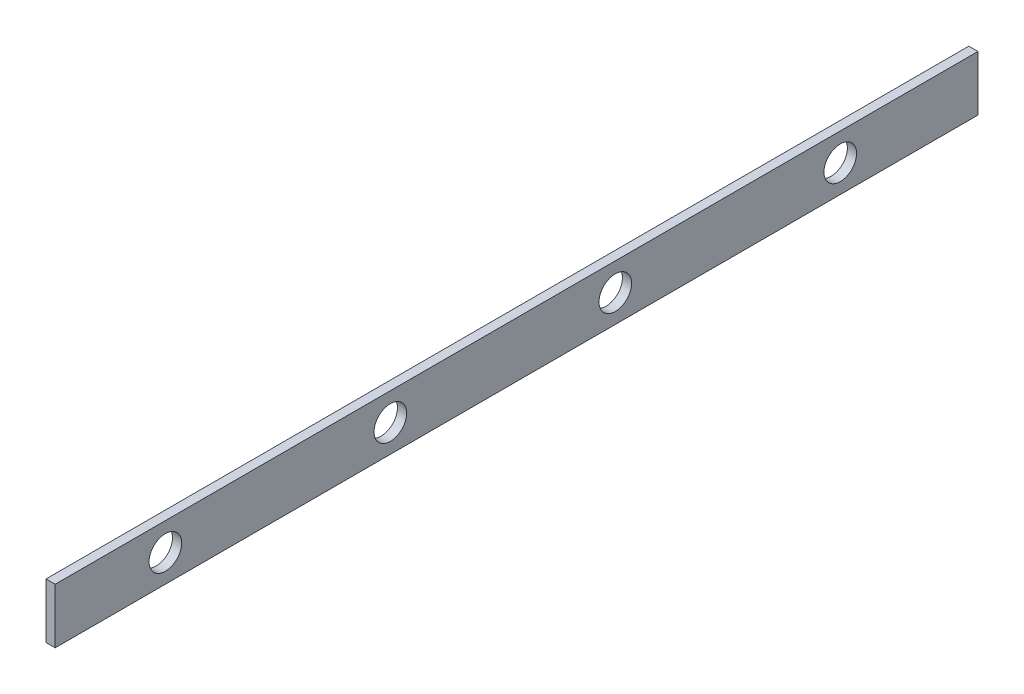
ISO-10303-21;
HEADER;
FILE_DESCRIPTION(('STEP AP214'),'2;1');
FILE_NAME('part.step','',(''),(''),'','','');
FILE_SCHEMA(('AUTOMOTIVE_DESIGN { 1 0 10303 214 1 1 1 1 }'));
ENDSEC;
DATA;
#1=APPLICATION_CONTEXT('core data for automotive mechanical design processes');
#2=APPLICATION_PROTOCOL_DEFINITION('international standard','automotive_design',2000,#1);
#3=PRODUCT_CONTEXT('',#1,'mechanical');
#4=PRODUCT('Part','Part','',(#3));
#5=PRODUCT_RELATED_PRODUCT_CATEGORY('part','',(#4));
#6=PRODUCT_DEFINITION_FORMATION('','',#4);
#7=PRODUCT_DEFINITION_CONTEXT('part definition',#1,'design');
#8=PRODUCT_DEFINITION('design','',#6,#7);
#9=PRODUCT_DEFINITION_SHAPE('','',#8);
#10=(LENGTH_UNIT() NAMED_UNIT(*) SI_UNIT(.MILLI.,.METRE.));
#11=(NAMED_UNIT(*) PLANE_ANGLE_UNIT() SI_UNIT($,.RADIAN.));
#12=(NAMED_UNIT(*) SI_UNIT($,.STERADIAN.) SOLID_ANGLE_UNIT());
#13=UNCERTAINTY_MEASURE_WITH_UNIT(LENGTH_MEASURE(1.E-05),#10,'distance_accuracy_value','');
#14=(GEOMETRIC_REPRESENTATION_CONTEXT(3) GLOBAL_UNCERTAINTY_ASSIGNED_CONTEXT((#13)) GLOBAL_UNIT_ASSIGNED_CONTEXT((#10,
#11,#12)) REPRESENTATION_CONTEXT('',''));
#15=CARTESIAN_POINT('',(0.,0.,0.));
#16=DIRECTION('',(0.,0.,1.));
#17=DIRECTION('',(1.,0.,0.));
#18=AXIS2_PLACEMENT_3D('',#15,#16,#17);
#19=CARTESIAN_POINT('',(600.,-60.000000000001,-502.500000000001));
#20=DIRECTION('',(0.,1.,0.));
#21=DIRECTION('',(0.,0.,1.));
#22=AXIS2_PLACEMENT_3D('',#19,#20,#21);
#23=PLANE('',#22);
#24=DIRECTION('',(-1.,0.,0.));
#25=VECTOR('',#24,1.);
#26=CARTESIAN_POINT('',(600.,-60.000000000001,502.499999999999));
#27=LINE('',#26,#25);
#28=CARTESIAN_POINT('',(610.,-60.000000000001,502.499999999999));
#29=VERTEX_POINT('',#28);
#30=CARTESIAN_POINT('',(600.,-60.000000000001,502.499999999999));
#31=VERTEX_POINT('',#30);
#32=EDGE_CURVE('E97',#29,#31,#27,.T.);
#33=ORIENTED_EDGE('',*,*,#32,.T.);
#34=DIRECTION('',(0.,0.,1.));
#35=VECTOR('',#34,1.);
#36=CARTESIAN_POINT('',(600.,-60.000000000001,-502.500000000001));
#37=LINE('',#36,#35);
#38=CARTESIAN_POINT('',(600.,-60.000000000001,-502.500000000001));
#39=VERTEX_POINT('',#38);
#40=EDGE_CURVE('E11',#39,#31,#37,.T.);
#41=ORIENTED_EDGE('',*,*,#40,.F.);
#42=DIRECTION('',(-1.,0.,0.));
#43=VECTOR('',#42,1.);
#44=CARTESIAN_POINT('',(600.,-60.000000000001,-502.500000000001));
#45=LINE('',#44,#43);
#46=CARTESIAN_POINT('',(610.,-60.000000000001,-502.500000000001));
#47=VERTEX_POINT('',#46);
#48=EDGE_CURVE('E85',#47,#39,#45,.T.);
#49=ORIENTED_EDGE('',*,*,#48,.F.);
#50=DIRECTION('',(0.,0.,1.));
#51=VECTOR('',#50,1.);
#52=CARTESIAN_POINT('',(610.,-60.000000000001,-502.500000000001));
#53=LINE('',#52,#51);
#54=EDGE_CURVE('E93',#47,#29,#53,.T.);
#55=ORIENTED_EDGE('',*,*,#54,.T.);
#56=EDGE_LOOP('',(#33,#41,#49,#55));
#57=FACE_BOUND('',#56,.T.);
#58=ADVANCED_FACE('F34',(#57),#23,.F.);
#59=CARTESIAN_POINT('',(600.,-60.000000000001,-502.500000000001));
#60=DIRECTION('',(1.,0.,0.));
#61=DIRECTION('',(0.,0.,-1.));
#62=AXIS2_PLACEMENT_3D('',#59,#60,#61);
#63=PLANE('',#62);
#64=CARTESIAN_POINT('',(600.,-30.0000000000042,382.499999999999));
#65=DIRECTION('',(1.,0.,0.));
#66=DIRECTION('',(0.,0.,-1.));
#67=AXIS2_PLACEMENT_3D('',#64,#65,#66);
#68=CIRCLE('',#67,17.75);
#69=CARTESIAN_POINT('',(600.,-30.0000000000042,364.75));
#70=VERTEX_POINT('',#69);
#71=EDGE_CURVE('E128',#70,#70,#68,.T.);
#72=ORIENTED_EDGE('',*,*,#71,.T.);
#73=EDGE_LOOP('',(#72));
#74=FACE_BOUND('',#73,.T.);
#75=CARTESIAN_POINT('',(600.,-30.0000000000042,137.5));
#76=DIRECTION('',(1.,0.,0.));
#77=DIRECTION('',(0.,0.,-1.));
#78=AXIS2_PLACEMENT_3D('',#75,#76,#77);
#79=CIRCLE('',#78,17.75);
#80=CARTESIAN_POINT('',(600.,-30.0000000000042,119.75));
#81=VERTEX_POINT('',#80);
#82=EDGE_CURVE('E122',#81,#81,#79,.T.);
#83=ORIENTED_EDGE('',*,*,#82,.T.);
#84=EDGE_LOOP('',(#83));
#85=FACE_BOUND('',#84,.T.);
#86=CARTESIAN_POINT('',(600.,-30.0000000000042,-107.5));
#87=DIRECTION('',(1.,0.,0.));
#88=DIRECTION('',(0.,0.,-1.));
#89=AXIS2_PLACEMENT_3D('',#86,#87,#88);
#90=CIRCLE('',#89,17.75);
#91=CARTESIAN_POINT('',(600.,-30.0000000000042,-125.25));
#92=VERTEX_POINT('',#91);
#93=EDGE_CURVE('E116',#92,#92,#90,.T.);
#94=ORIENTED_EDGE('',*,*,#93,.T.);
#95=EDGE_LOOP('',(#94));
#96=FACE_BOUND('',#95,.T.);
#97=CARTESIAN_POINT('',(600.,-30.0000000000042,-352.5));
#98=DIRECTION('',(1.,0.,0.));
#99=DIRECTION('',(0.,0.,-1.));
#100=AXIS2_PLACEMENT_3D('',#97,#98,#99);
#101=CIRCLE('',#100,17.75);
#102=CARTESIAN_POINT('',(600.,-30.0000000000042,-370.25));
#103=VERTEX_POINT('',#102);
#104=EDGE_CURVE('E100',#103,#103,#101,.T.);
#105=ORIENTED_EDGE('',*,*,#104,.T.);
#106=EDGE_LOOP('',(#105));
#107=FACE_BOUND('',#106,.T.);
#108=DIRECTION('',(0.,1.,0.));
#109=VECTOR('',#108,1.);
#110=CARTESIAN_POINT('',(600.,-60.000000000001,502.499999999999));
#111=LINE('',#110,#109);
#112=CARTESIAN_POINT('',(600.,0.,502.499999999999));
#113=VERTEX_POINT('',#112);
#114=EDGE_CURVE('E89',#31,#113,#111,.T.);
#115=ORIENTED_EDGE('',*,*,#114,.T.);
#116=DIRECTION('',(0.,0.,1.));
#117=VECTOR('',#116,1.);
#118=CARTESIAN_POINT('',(600.,0.,-502.500000000001));
#119=LINE('',#118,#117);
#120=CARTESIAN_POINT('',(600.,0.,-502.500000000001));
#121=VERTEX_POINT('',#120);
#122=EDGE_CURVE('E42',#121,#113,#119,.T.);
#123=ORIENTED_EDGE('',*,*,#122,.F.);
#124=DIRECTION('',(0.,1.,0.));
#125=VECTOR('',#124,1.);
#126=CARTESIAN_POINT('',(600.,-60.000000000001,-502.500000000001));
#127=LINE('',#126,#125);
#128=EDGE_CURVE('E80',#39,#121,#127,.T.);
#129=ORIENTED_EDGE('',*,*,#128,.F.);
#130=ORIENTED_EDGE('',*,*,#40,.T.);
#131=EDGE_LOOP('',(#115,#123,#129,#130));
#132=FACE_BOUND('',#131,.T.);
#133=ADVANCED_FACE('F88',(#74,#85,#96,#107,#132),#63,.F.);
#134=CARTESIAN_POINT('',(610.,0.,-502.500000000001));
#135=DIRECTION('',(0.,-1.,0.));
#136=DIRECTION('',(0.,0.,-1.));
#137=AXIS2_PLACEMENT_3D('',#134,#135,#136);
#138=PLANE('',#137);
#139=DIRECTION('',(1.,0.,0.));
#140=VECTOR('',#139,1.);
#141=CARTESIAN_POINT('',(610.,0.,502.499999999999));
#142=LINE('',#141,#140);
#143=CARTESIAN_POINT('',(610.,0.,502.499999999999));
#144=VERTEX_POINT('',#143);
#145=EDGE_CURVE('E67',#113,#144,#142,.T.);
#146=ORIENTED_EDGE('',*,*,#145,.T.);
#147=DIRECTION('',(0.,0.,1.));
#148=VECTOR('',#147,1.);
#149=CARTESIAN_POINT('',(610.,0.,-502.500000000001));
#150=LINE('',#149,#148);
#151=CARTESIAN_POINT('',(610.,0.,-502.500000000001));
#152=VERTEX_POINT('',#151);
#153=EDGE_CURVE('E90',#152,#144,#150,.T.);
#154=ORIENTED_EDGE('',*,*,#153,.F.);
#155=DIRECTION('',(1.,0.,0.));
#156=VECTOR('',#155,1.);
#157=CARTESIAN_POINT('',(610.,0.,-502.500000000001));
#158=LINE('',#157,#156);
#159=EDGE_CURVE('E83',#121,#152,#158,.T.);
#160=ORIENTED_EDGE('',*,*,#159,.F.);
#161=ORIENTED_EDGE('',*,*,#122,.T.);
#162=EDGE_LOOP('',(#146,#154,#160,#161));
#163=FACE_BOUND('',#162,.T.);
#164=ADVANCED_FACE('F91',(#163),#138,.F.);
#165=CARTESIAN_POINT('',(610.,-60.000000000001,-502.500000000001));
#166=DIRECTION('',(-1.,0.,0.));
#167=DIRECTION('',(0.,0.,1.));
#168=AXIS2_PLACEMENT_3D('',#165,#166,#167);
#169=PLANE('',#168);
#170=CARTESIAN_POINT('',(610.,-30.0000000000042,382.499999999999));
#171=DIRECTION('',(-1.,0.,0.));
#172=DIRECTION('',(0.,0.,1.));
#173=AXIS2_PLACEMENT_3D('',#170,#171,#172);
#174=CIRCLE('',#173,17.75);
#175=CARTESIAN_POINT('',(610.,-30.0000000000042,400.249999999999));
#176=VERTEX_POINT('',#175);
#177=EDGE_CURVE('E131',#176,#176,#174,.T.);
#178=ORIENTED_EDGE('',*,*,#177,.T.);
#179=EDGE_LOOP('',(#178));
#180=FACE_BOUND('',#179,.T.);
#181=CARTESIAN_POINT('',(610.,-30.0000000000042,137.5));
#182=DIRECTION('',(-1.,0.,0.));
#183=DIRECTION('',(0.,0.,1.));
#184=AXIS2_PLACEMENT_3D('',#181,#182,#183);
#185=CIRCLE('',#184,17.75);
#186=CARTESIAN_POINT('',(610.,-30.0000000000042,155.25));
#187=VERTEX_POINT('',#186);
#188=EDGE_CURVE('E125',#187,#187,#185,.T.);
#189=ORIENTED_EDGE('',*,*,#188,.T.);
#190=EDGE_LOOP('',(#189));
#191=FACE_BOUND('',#190,.T.);
#192=CARTESIAN_POINT('',(610.,-30.0000000000042,-107.5));
#193=DIRECTION('',(-1.,0.,0.));
#194=DIRECTION('',(0.,0.,1.));
#195=AXIS2_PLACEMENT_3D('',#192,#193,#194);
#196=CIRCLE('',#195,17.75);
#197=CARTESIAN_POINT('',(610.,-30.0000000000042,-89.7500000000005));
#198=VERTEX_POINT('',#197);
#199=EDGE_CURVE('E119',#198,#198,#196,.T.);
#200=ORIENTED_EDGE('',*,*,#199,.T.);
#201=EDGE_LOOP('',(#200));
#202=FACE_BOUND('',#201,.T.);
#203=CARTESIAN_POINT('',(610.,-30.0000000000042,-352.5));
#204=DIRECTION('',(-1.,0.,0.));
#205=DIRECTION('',(0.,0.,1.));
#206=AXIS2_PLACEMENT_3D('',#203,#204,#205);
#207=CIRCLE('',#206,17.75);
#208=CARTESIAN_POINT('',(610.,-30.0000000000042,-334.750000000001));
#209=VERTEX_POINT('',#208);
#210=EDGE_CURVE('E113',#209,#209,#207,.T.);
#211=ORIENTED_EDGE('',*,*,#210,.T.);
#212=EDGE_LOOP('',(#211));
#213=FACE_BOUND('',#212,.T.);
#214=DIRECTION('',(0.,-1.,0.));
#215=VECTOR('',#214,1.);
#216=CARTESIAN_POINT('',(610.,-60.000000000001,502.499999999999));
#217=LINE('',#216,#215);
#218=EDGE_CURVE('E73',#144,#29,#217,.T.);
#219=ORIENTED_EDGE('',*,*,#218,.T.);
#220=ORIENTED_EDGE('',*,*,#54,.F.);
#221=DIRECTION('',(0.,-1.,0.));
#222=VECTOR('',#221,1.);
#223=CARTESIAN_POINT('',(610.,-60.000000000001,-502.500000000001));
#224=LINE('',#223,#222);
#225=EDGE_CURVE('E50',#152,#47,#224,.T.);
#226=ORIENTED_EDGE('',*,*,#225,.F.);
#227=ORIENTED_EDGE('',*,*,#153,.T.);
#228=EDGE_LOOP('',(#219,#220,#226,#227));
#229=FACE_BOUND('',#228,.T.);
#230=ADVANCED_FACE('F105',(#180,#191,#202,#213,#229),#169,.F.);
#231=CARTESIAN_POINT('',(1205.,-30.0000000000005,-502.500000000001));
#232=DIRECTION('',(0.,0.,1.));
#233=DIRECTION('',(1.,0.,0.));
#234=AXIS2_PLACEMENT_3D('',#231,#232,#233);
#235=PLANE('',#234);
#236=ORIENTED_EDGE('',*,*,#48,.T.);
#237=ORIENTED_EDGE('',*,*,#128,.T.);
#238=ORIENTED_EDGE('',*,*,#159,.T.);
#239=ORIENTED_EDGE('',*,*,#225,.T.);
#240=EDGE_LOOP('',(#236,#237,#238,#239));
#241=FACE_BOUND('',#240,.T.);
#242=ADVANCED_FACE('F81',(#241),#235,.F.);
#243=CARTESIAN_POINT('',(1205.,-30.0000000000005,502.499999999999));
#244=DIRECTION('',(0.,0.,1.));
#245=DIRECTION('',(1.,0.,0.));
#246=AXIS2_PLACEMENT_3D('',#243,#244,#245);
#247=PLANE('',#246);
#248=ORIENTED_EDGE('',*,*,#32,.F.);
#249=ORIENTED_EDGE('',*,*,#218,.F.);
#250=ORIENTED_EDGE('',*,*,#145,.F.);
#251=ORIENTED_EDGE('',*,*,#114,.F.);
#252=EDGE_LOOP('',(#248,#249,#250,#251));
#253=FACE_BOUND('',#252,.T.);
#254=ADVANCED_FACE('F108',(#253),#247,.T.);
#255=CARTESIAN_POINT('',(610.,-30.0000000000042,-352.5));
#256=DIRECTION('',(-1.,0.,0.));
#257=DIRECTION('',(0.,0.,1.));
#258=AXIS2_PLACEMENT_3D('',#255,#256,#257);
#259=CYLINDRICAL_SURFACE('',#258,17.75);
#260=ORIENTED_EDGE('',*,*,#210,.F.);
#261=EDGE_LOOP('',(#260));
#262=FACE_BOUND('',#261,.T.);
#263=ORIENTED_EDGE('',*,*,#104,.F.);
#264=EDGE_LOOP('',(#263));
#265=FACE_BOUND('',#264,.T.);
#266=ADVANCED_FACE('F152',(#262,#265),#259,.F.);
#267=CARTESIAN_POINT('',(610.,-30.0000000000042,-107.5));
#268=DIRECTION('',(-1.,0.,0.));
#269=DIRECTION('',(0.,0.,1.));
#270=AXIS2_PLACEMENT_3D('',#267,#268,#269);
#271=CYLINDRICAL_SURFACE('',#270,17.75);
#272=ORIENTED_EDGE('',*,*,#199,.F.);
#273=EDGE_LOOP('',(#272));
#274=FACE_BOUND('',#273,.T.);
#275=ORIENTED_EDGE('',*,*,#93,.F.);
#276=EDGE_LOOP('',(#275));
#277=FACE_BOUND('',#276,.T.);
#278=ADVANCED_FACE('F154',(#274,#277),#271,.F.);
#279=CARTESIAN_POINT('',(610.,-30.0000000000042,137.5));
#280=DIRECTION('',(-1.,0.,0.));
#281=DIRECTION('',(0.,0.,1.));
#282=AXIS2_PLACEMENT_3D('',#279,#280,#281);
#283=CYLINDRICAL_SURFACE('',#282,17.75);
#284=ORIENTED_EDGE('',*,*,#188,.F.);
#285=EDGE_LOOP('',(#284));
#286=FACE_BOUND('',#285,.T.);
#287=ORIENTED_EDGE('',*,*,#82,.F.);
#288=EDGE_LOOP('',(#287));
#289=FACE_BOUND('',#288,.T.);
#290=ADVANCED_FACE('F140',(#286,#289),#283,.F.);
#291=CARTESIAN_POINT('',(610.,-30.0000000000042,382.499999999999));
#292=DIRECTION('',(-1.,0.,0.));
#293=DIRECTION('',(0.,0.,1.));
#294=AXIS2_PLACEMENT_3D('',#291,#292,#293);
#295=CYLINDRICAL_SURFACE('',#294,17.75);
#296=ORIENTED_EDGE('',*,*,#177,.F.);
#297=EDGE_LOOP('',(#296));
#298=FACE_BOUND('',#297,.T.);
#299=ORIENTED_EDGE('',*,*,#71,.F.);
#300=EDGE_LOOP('',(#299));
#301=FACE_BOUND('',#300,.T.);
#302=ADVANCED_FACE('F137',(#298,#301),#295,.F.);
#303=CLOSED_SHELL('',(#58,#133,#164,#230,#242,#254,#266,#278,#290,#302));
#304=MANIFOLD_SOLID_BREP('B2',#303);
#305=ADVANCED_BREP_SHAPE_REPRESENTATION('',(#18,#304),#14);
#306=SHAPE_DEFINITION_REPRESENTATION(#9,#305);
ENDSEC;
END-ISO-10303-21;
